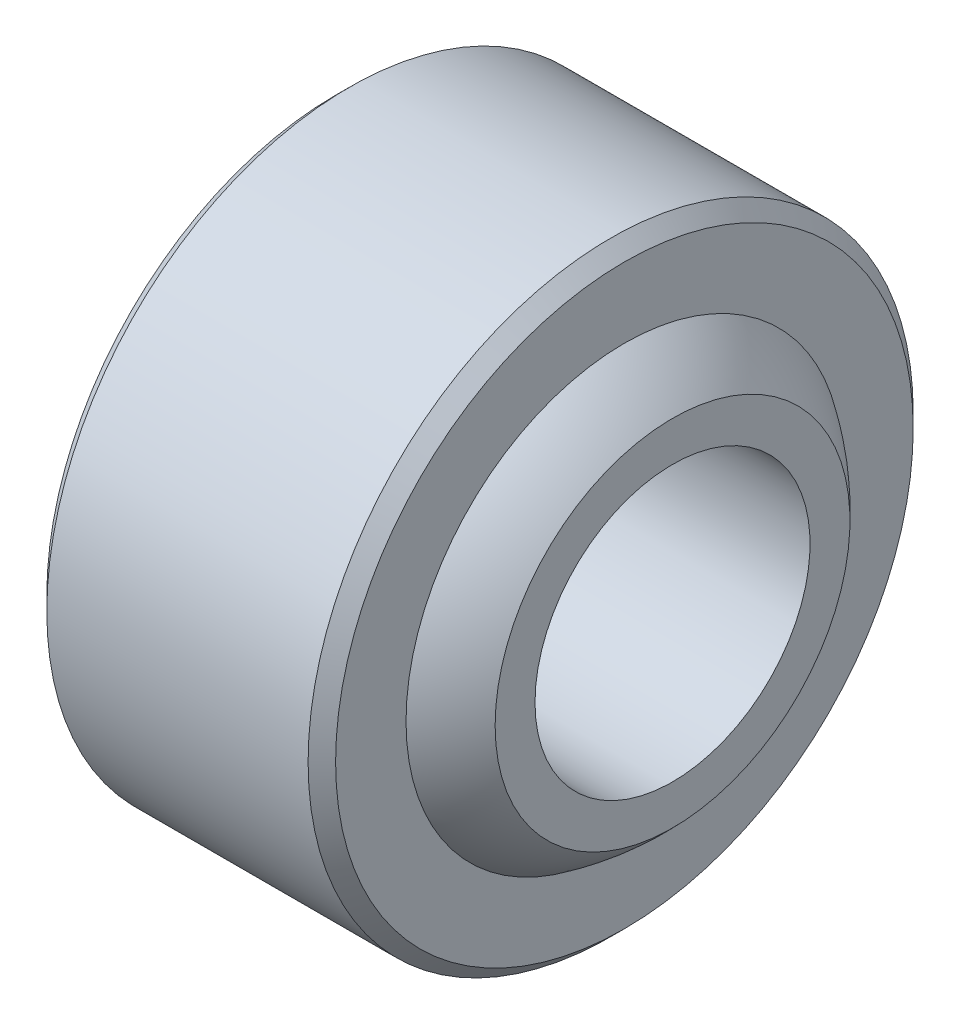
ISO-10303-21;
HEADER;
FILE_DESCRIPTION(('STEP AP214'),'2;1');
FILE_NAME('part.step','',(''),(''),'','','');
FILE_SCHEMA(('AUTOMOTIVE_DESIGN { 1 0 10303 214 1 1 1 1 }'));
ENDSEC;
DATA;
#1=APPLICATION_CONTEXT('core data for automotive mechanical design processes');
#2=APPLICATION_PROTOCOL_DEFINITION('international standard','automotive_design',2000,#1);
#3=PRODUCT_CONTEXT('',#1,'mechanical');
#4=PRODUCT('Part','Part','',(#3));
#5=PRODUCT_RELATED_PRODUCT_CATEGORY('part','',(#4));
#6=PRODUCT_DEFINITION_FORMATION('','',#4);
#7=PRODUCT_DEFINITION_CONTEXT('part definition',#1,'design');
#8=PRODUCT_DEFINITION('design','',#6,#7);
#9=PRODUCT_DEFINITION_SHAPE('','',#8);
#10=(LENGTH_UNIT() NAMED_UNIT(*) SI_UNIT(.MILLI.,.METRE.));
#11=(NAMED_UNIT(*) PLANE_ANGLE_UNIT() SI_UNIT($,.RADIAN.));
#12=(NAMED_UNIT(*) SI_UNIT($,.STERADIAN.) SOLID_ANGLE_UNIT());
#13=UNCERTAINTY_MEASURE_WITH_UNIT(LENGTH_MEASURE(1.E-05),#10,'distance_accuracy_value','');
#14=(GEOMETRIC_REPRESENTATION_CONTEXT(3) GLOBAL_UNCERTAINTY_ASSIGNED_CONTEXT((#13)) GLOBAL_UNIT_ASSIGNED_CONTEXT((#10,
#11,#12)) REPRESENTATION_CONTEXT('',''));
#15=CARTESIAN_POINT('',(0.,0.,0.));
#16=DIRECTION('',(0.,0.,1.));
#17=DIRECTION('',(1.,0.,0.));
#18=AXIS2_PLACEMENT_3D('',#15,#16,#17);
#19=CARTESIAN_POINT('',(-7.,0.,0.));
#20=DIRECTION('',(1.,0.,0.));
#21=DIRECTION('',(0.,0.,-1.));
#22=AXIS2_PLACEMENT_3D('',#19,#20,#21);
#23=PLANE('',#22);
#24=CARTESIAN_POINT('',(-7.,-5.,0.));
#25=DIRECTION('',(-1.,0.,0.));
#26=DIRECTION('',(0.,0.,1.));
#27=AXIS2_PLACEMENT_3D('',#24,#25,#26);
#28=CIRCLE('',#27,5.);
#29=CARTESIAN_POINT('',(-7.,-5.,5.));
#30=VERTEX_POINT('',#29);
#31=EDGE_CURVE('E52',#30,#30,#28,.T.);
#32=ORIENTED_EDGE('',*,*,#31,.F.);
#33=EDGE_LOOP('',(#32));
#34=FACE_BOUND('',#33,.T.);
#35=CARTESIAN_POINT('',(-7.,-5.,0.));
#36=DIRECTION('',(-1.,0.,0.));
#37=DIRECTION('',(0.,0.,1.));
#38=AXIS2_PLACEMENT_3D('',#35,#36,#37);
#39=CIRCLE('',#38,6.45);
#40=CARTESIAN_POINT('',(-7.,-5.,6.45));
#41=VERTEX_POINT('',#40);
#42=EDGE_CURVE('E67',#41,#41,#39,.T.);
#43=ORIENTED_EDGE('',*,*,#42,.T.);
#44=EDGE_LOOP('',(#43));
#45=FACE_BOUND('',#44,.T.);
#46=ADVANCED_FACE('F32',(#34,#45),#23,.F.);
#47=CARTESIAN_POINT('',(-7.65040690041396,-5.,0.));
#48=DIRECTION('',(-1.,0.,0.));
#49=DIRECTION('',(0.,0.,1.));
#50=AXIS2_PLACEMENT_3D('',#47,#48,#49);
#51=CYLINDRICAL_SURFACE('',#50,5.);
#52=CARTESIAN_POINT('',(7.,-5.,0.));
#53=DIRECTION('',(-1.,0.,0.));
#54=DIRECTION('',(0.,0.,1.));
#55=AXIS2_PLACEMENT_3D('',#52,#53,#54);
#56=CIRCLE('',#55,5.);
#57=CARTESIAN_POINT('',(7.,-5.,5.));
#58=VERTEX_POINT('',#57);
#59=EDGE_CURVE('E55',#58,#58,#56,.T.);
#60=ORIENTED_EDGE('',*,*,#59,.F.);
#61=EDGE_LOOP('',(#60));
#62=FACE_BOUND('',#61,.T.);
#63=ORIENTED_EDGE('',*,*,#31,.T.);
#64=EDGE_LOOP('',(#63));
#65=FACE_BOUND('',#64,.T.);
#66=ADVANCED_FACE('F90',(#62,#65),#51,.F.);
#67=CARTESIAN_POINT('',(7.,0.,0.));
#68=DIRECTION('',(-1.,0.,0.));
#69=DIRECTION('',(0.,0.,1.));
#70=AXIS2_PLACEMENT_3D('',#67,#68,#69);
#71=PLANE('',#70);
#72=CARTESIAN_POINT('',(7.,-5.,0.));
#73=DIRECTION('',(-1.,0.,0.));
#74=DIRECTION('',(0.,0.,1.));
#75=AXIS2_PLACEMENT_3D('',#72,#73,#74);
#76=CIRCLE('',#75,6.45);
#77=CARTESIAN_POINT('',(7.,-5.,6.45));
#78=VERTEX_POINT('',#77);
#79=EDGE_CURVE('E58',#78,#78,#76,.T.);
#80=ORIENTED_EDGE('',*,*,#79,.F.);
#81=EDGE_LOOP('',(#80));
#82=FACE_BOUND('',#81,.T.);
#83=ORIENTED_EDGE('',*,*,#59,.T.);
#84=EDGE_LOOP('',(#83));
#85=FACE_BOUND('',#84,.T.);
#86=ADVANCED_FACE('F96',(#82,#85),#71,.F.);
#87=CARTESIAN_POINT('',(0.,-5.,0.));
#88=DIRECTION('',(-1.,0.,0.));
#89=DIRECTION('',(0.,1.,0.));
#90=AXIS2_PLACEMENT_3D('',#87,#88,#89);
#91=SPHERICAL_SURFACE('',#90,9.51853455107455);
#92=CARTESIAN_POINT('',(5.25,-5.,0.));
#93=DIRECTION('',(-1.,0.,0.));
#94=DIRECTION('',(0.,0.,1.));
#95=AXIS2_PLACEMENT_3D('',#92,#93,#94);
#96=CIRCLE('',#95,7.93977329651168);
#97=CARTESIAN_POINT('',(5.25,-5.,7.93977329651168));
#98=VERTEX_POINT('',#97);
#99=EDGE_CURVE('E61',#98,#98,#96,.T.);
#100=ORIENTED_EDGE('',*,*,#99,.F.);
#101=EDGE_LOOP('',(#100));
#102=FACE_BOUND('',#101,.T.);
#103=ORIENTED_EDGE('',*,*,#79,.T.);
#104=EDGE_LOOP('',(#103));
#105=FACE_BOUND('',#104,.T.);
#106=ADVANCED_FACE('F138',(#102,#105),#91,.T.);
#107=CARTESIAN_POINT('',(5.25,6.,0.));
#108=DIRECTION('',(-1.,0.,0.));
#109=DIRECTION('',(0.,0.,1.));
#110=AXIS2_PLACEMENT_3D('',#107,#108,#109);
#111=PLANE('',#110);
#112=CARTESIAN_POINT('',(5.25,-5.,0.));
#113=DIRECTION('',(-1.,0.,0.));
#114=DIRECTION('',(0.,0.,1.));
#115=AXIS2_PLACEMENT_3D('',#112,#113,#114);
#116=CIRCLE('',#115,10.5);
#117=CARTESIAN_POINT('',(5.25,-5.,10.5));
#118=VERTEX_POINT('',#117);
#119=EDGE_CURVE('E10',#118,#118,#116,.F.);
#120=ORIENTED_EDGE('',*,*,#119,.T.);
#121=EDGE_LOOP('',(#120));
#122=FACE_BOUND('',#121,.T.);
#123=ORIENTED_EDGE('',*,*,#99,.T.);
#124=EDGE_LOOP('',(#123));
#125=FACE_BOUND('',#124,.T.);
#126=ADVANCED_FACE('F87',(#122,#125),#111,.F.);
#127=CARTESIAN_POINT('',(-7.65040690041396,-5.,0.));
#128=DIRECTION('',(-1.,0.,0.));
#129=DIRECTION('',(0.,0.,1.));
#130=AXIS2_PLACEMENT_3D('',#127,#128,#129);
#131=CYLINDRICAL_SURFACE('',#130,11.);
#132=CARTESIAN_POINT('',(-4.75,-5.,0.));
#133=DIRECTION('',(1.,0.,0.));
#134=DIRECTION('',(0.,0.,-1.));
#135=AXIS2_PLACEMENT_3D('',#132,#133,#134);
#136=CIRCLE('',#135,11.);
#137=CARTESIAN_POINT('',(-4.75,-5.,-11.));
#138=VERTEX_POINT('',#137);
#139=EDGE_CURVE('E39',#138,#138,#136,.T.);
#140=ORIENTED_EDGE('',*,*,#139,.T.);
#141=EDGE_LOOP('',(#140));
#142=FACE_BOUND('',#141,.T.);
#143=CARTESIAN_POINT('',(4.75,-5.,0.));
#144=DIRECTION('',(-1.,0.,0.));
#145=DIRECTION('',(0.,0.,1.));
#146=AXIS2_PLACEMENT_3D('',#143,#144,#145);
#147=CIRCLE('',#146,11.);
#148=CARTESIAN_POINT('',(4.75,-5.,11.));
#149=VERTEX_POINT('',#148);
#150=EDGE_CURVE('E43',#149,#149,#147,.T.);
#151=ORIENTED_EDGE('',*,*,#150,.T.);
#152=EDGE_LOOP('',(#151));
#153=FACE_BOUND('',#152,.T.);
#154=ADVANCED_FACE('F81',(#142,#153),#131,.T.);
#155=CARTESIAN_POINT('',(-5.25,6.,0.));
#156=DIRECTION('',(1.,0.,0.));
#157=DIRECTION('',(0.,0.,-1.));
#158=AXIS2_PLACEMENT_3D('',#155,#156,#157);
#159=PLANE('',#158);
#160=CARTESIAN_POINT('',(-5.25,-5.,0.));
#161=DIRECTION('',(1.,0.,0.));
#162=DIRECTION('',(0.,0.,-1.));
#163=AXIS2_PLACEMENT_3D('',#160,#161,#162);
#164=CIRCLE('',#163,10.5);
#165=CARTESIAN_POINT('',(-5.25,-5.,-10.5));
#166=VERTEX_POINT('',#165);
#167=EDGE_CURVE('E47',#166,#166,#164,.F.);
#168=ORIENTED_EDGE('',*,*,#167,.T.);
#169=EDGE_LOOP('',(#168));
#170=FACE_BOUND('',#169,.T.);
#171=CARTESIAN_POINT('',(-5.25,-5.,0.));
#172=DIRECTION('',(-1.,0.,0.));
#173=DIRECTION('',(0.,0.,1.));
#174=AXIS2_PLACEMENT_3D('',#171,#172,#173);
#175=CIRCLE('',#174,7.93977329651168);
#176=CARTESIAN_POINT('',(-5.25,-5.,7.93977329651168));
#177=VERTEX_POINT('',#176);
#178=EDGE_CURVE('E64',#177,#177,#175,.T.);
#179=ORIENTED_EDGE('',*,*,#178,.F.);
#180=EDGE_LOOP('',(#179));
#181=FACE_BOUND('',#180,.T.);
#182=ADVANCED_FACE('F76',(#170,#181),#159,.F.);
#183=CARTESIAN_POINT('',(0.,-5.,0.));
#184=DIRECTION('',(-1.,0.,0.));
#185=DIRECTION('',(0.,1.,0.));
#186=AXIS2_PLACEMENT_3D('',#183,#184,#185);
#187=SPHERICAL_SURFACE('',#186,9.51853455107455);
#188=ORIENTED_EDGE('',*,*,#42,.F.);
#189=EDGE_LOOP('',(#188));
#190=FACE_BOUND('',#189,.T.);
#191=ORIENTED_EDGE('',*,*,#178,.T.);
#192=EDGE_LOOP('',(#191));
#193=FACE_BOUND('',#192,.T.);
#194=ADVANCED_FACE('F72',(#190,#193),#187,.T.);
#195=CARTESIAN_POINT('',(-5.25,-5.,0.));
#196=DIRECTION('',(1.,0.,0.));
#197=DIRECTION('',(0.,0.,-1.));
#198=AXIS2_PLACEMENT_3D('',#195,#196,#197);
#199=CONICAL_SURFACE('',#198,10.5,0.785398163397441);
#200=ORIENTED_EDGE('',*,*,#139,.F.);
#201=EDGE_LOOP('',(#200));
#202=FACE_BOUND('',#201,.T.);
#203=ORIENTED_EDGE('',*,*,#167,.F.);
#204=EDGE_LOOP('',(#203));
#205=FACE_BOUND('',#204,.T.);
#206=ADVANCED_FACE('F75',(#202,#205),#199,.T.);
#207=CARTESIAN_POINT('',(4.75,-5.,0.));
#208=DIRECTION('',(-1.,0.,0.));
#209=DIRECTION('',(0.,0.,1.));
#210=AXIS2_PLACEMENT_3D('',#207,#208,#209);
#211=CONICAL_SURFACE('',#210,11.,0.78539816339745);
#212=ORIENTED_EDGE('',*,*,#119,.F.);
#213=EDGE_LOOP('',(#212));
#214=FACE_BOUND('',#213,.T.);
#215=ORIENTED_EDGE('',*,*,#150,.F.);
#216=EDGE_LOOP('',(#215));
#217=FACE_BOUND('',#216,.T.);
#218=ADVANCED_FACE('F34',(#214,#217),#211,.T.);
#219=CLOSED_SHELL('',(#46,#66,#86,#106,#126,#154,#182,#194,#206,#218));
#220=MANIFOLD_SOLID_BREP('B2',#219);
#221=ADVANCED_BREP_SHAPE_REPRESENTATION('',(#18,#220),#14);
#222=SHAPE_DEFINITION_REPRESENTATION(#9,#221);
ENDSEC;
END-ISO-10303-21;
